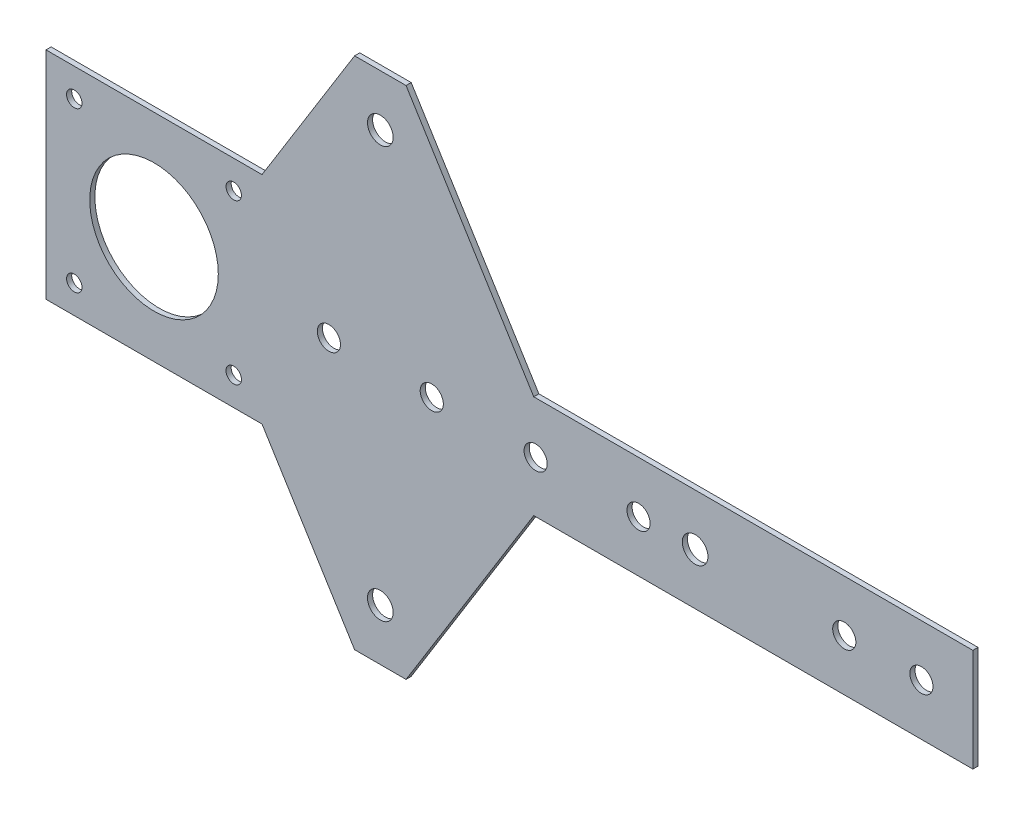
ISO-10303-21;
HEADER;
FILE_DESCRIPTION(('STEP AP214'),'2;1');
FILE_NAME('part.step','',(''),(''),'','','');
FILE_SCHEMA(('AUTOMOTIVE_DESIGN { 1 0 10303 214 1 1 1 1 }'));
ENDSEC;
DATA;
#1=APPLICATION_CONTEXT('core data for automotive mechanical design processes');
#2=APPLICATION_PROTOCOL_DEFINITION('international standard','automotive_design',2000,#1);
#3=PRODUCT_CONTEXT('',#1,'mechanical');
#4=PRODUCT('Part','Part','',(#3));
#5=PRODUCT_RELATED_PRODUCT_CATEGORY('part','',(#4));
#6=PRODUCT_DEFINITION_FORMATION('','',#4);
#7=PRODUCT_DEFINITION_CONTEXT('part definition',#1,'design');
#8=PRODUCT_DEFINITION('design','',#6,#7);
#9=PRODUCT_DEFINITION_SHAPE('','',#8);
#10=(LENGTH_UNIT() NAMED_UNIT(*) SI_UNIT(.MILLI.,.METRE.));
#11=(NAMED_UNIT(*) PLANE_ANGLE_UNIT() SI_UNIT($,.RADIAN.));
#12=(NAMED_UNIT(*) SI_UNIT($,.STERADIAN.) SOLID_ANGLE_UNIT());
#13=UNCERTAINTY_MEASURE_WITH_UNIT(LENGTH_MEASURE(1.E-05),#10,'distance_accuracy_value','');
#14=(GEOMETRIC_REPRESENTATION_CONTEXT(3) GLOBAL_UNCERTAINTY_ASSIGNED_CONTEXT((#13)) GLOBAL_UNIT_ASSIGNED_CONTEXT((#10,
#11,#12)) REPRESENTATION_CONTEXT('',''));
#15=CARTESIAN_POINT('',(0.,0.,0.));
#16=DIRECTION('',(0.,0.,1.));
#17=DIRECTION('',(1.,0.,0.));
#18=AXIS2_PLACEMENT_3D('',#15,#16,#17);
#19=CARTESIAN_POINT('',(-90.1,-21.,-1.));
#20=DIRECTION('',(-1.,0.,0.));
#21=DIRECTION('',(0.,0.,1.));
#22=AXIS2_PLACEMENT_3D('',#19,#20,#21);
#23=PLANE('',#22);
#24=DIRECTION('',(0.,-1.,0.));
#25=VECTOR('',#24,1.);
#26=CARTESIAN_POINT('',(-90.1,-21.,0.));
#27=LINE('',#26,#25);
#28=CARTESIAN_POINT('',(-90.1,21.,0.));
#29=VERTEX_POINT('',#28);
#30=CARTESIAN_POINT('',(-90.1,-21.,0.));
#31=VERTEX_POINT('',#30);
#32=EDGE_CURVE('E160',#29,#31,#27,.T.);
#33=ORIENTED_EDGE('',*,*,#32,.F.);
#34=DIRECTION('',(0.,0.,1.));
#35=VECTOR('',#34,1.);
#36=CARTESIAN_POINT('',(-90.1,21.,-1.));
#37=LINE('',#36,#35);
#38=CARTESIAN_POINT('',(-90.1,21.,-1.));
#39=VERTEX_POINT('',#38);
#40=EDGE_CURVE('E11',#39,#29,#37,.T.);
#41=ORIENTED_EDGE('',*,*,#40,.F.);
#42=DIRECTION('',(0.,-1.,0.));
#43=VECTOR('',#42,1.);
#44=CARTESIAN_POINT('',(-90.1,-21.,-1.));
#45=LINE('',#44,#43);
#46=CARTESIAN_POINT('',(-90.1,-21.,-1.));
#47=VERTEX_POINT('',#46);
#48=EDGE_CURVE('E193',#39,#47,#45,.T.);
#49=ORIENTED_EDGE('',*,*,#48,.T.);
#50=DIRECTION('',(0.,0.,1.));
#51=VECTOR('',#50,1.);
#52=CARTESIAN_POINT('',(-90.1,-21.,-1.));
#53=LINE('',#52,#51);
#54=EDGE_CURVE('E42',#47,#31,#53,.T.);
#55=ORIENTED_EDGE('',*,*,#54,.T.);
#56=EDGE_LOOP('',(#33,#41,#49,#55));
#57=FACE_BOUND('',#56,.T.);
#58=ADVANCED_FACE('F39',(#57),#23,.T.);
#59=CARTESIAN_POINT('',(-90.1,21.,-1.));
#60=DIRECTION('',(0.,1.,0.));
#61=DIRECTION('',(-1.,0.,0.));
#62=AXIS2_PLACEMENT_3D('',#59,#60,#61);
#63=PLANE('',#62);
#64=DIRECTION('',(-1.,0.,0.));
#65=VECTOR('',#64,1.);
#66=CARTESIAN_POINT('',(-90.1,21.,0.));
#67=LINE('',#66,#65);
#68=CARTESIAN_POINT('',(-48.1,21.,0.));
#69=VERTEX_POINT('',#68);
#70=EDGE_CURVE('E191',#69,#29,#67,.T.);
#71=ORIENTED_EDGE('',*,*,#70,.F.);
#72=DIRECTION('',(0.,0.,1.));
#73=VECTOR('',#72,1.);
#74=CARTESIAN_POINT('',(-48.1,21.,-1.));
#75=LINE('',#74,#73);
#76=CARTESIAN_POINT('',(-48.1,21.,-1.));
#77=VERTEX_POINT('',#76);
#78=EDGE_CURVE('E48',#77,#69,#75,.T.);
#79=ORIENTED_EDGE('',*,*,#78,.F.);
#80=DIRECTION('',(-1.,0.,0.));
#81=VECTOR('',#80,1.);
#82=CARTESIAN_POINT('',(-90.1,21.,-1.));
#83=LINE('',#82,#81);
#84=EDGE_CURVE('E150',#77,#39,#83,.T.);
#85=ORIENTED_EDGE('',*,*,#84,.T.);
#86=ORIENTED_EDGE('',*,*,#40,.T.);
#87=EDGE_LOOP('',(#71,#79,#85,#86));
#88=FACE_BOUND('',#87,.T.);
#89=ADVANCED_FACE('F213',(#88),#63,.T.);
#90=CARTESIAN_POINT('',(-48.1,21.,-1.));
#91=DIRECTION('',(-0.849640166198119,0.527362861778144,0.));
#92=DIRECTION('',(-0.527362861778144,-0.849640166198119,0.));
#93=AXIS2_PLACEMENT_3D('',#90,#91,#92);
#94=PLANE('',#93);
#95=DIRECTION('',(-0.527362861778144,-0.849640166198119,0.));
#96=VECTOR('',#95,1.);
#97=CARTESIAN_POINT('',(-48.1,21.,0.));
#98=LINE('',#97,#96);
#99=CARTESIAN_POINT('',(-30.1,50.,0.));
#100=VERTEX_POINT('',#99);
#101=EDGE_CURVE('E137',#100,#69,#98,.T.);
#102=ORIENTED_EDGE('',*,*,#101,.F.);
#103=DIRECTION('',(0.,0.,1.));
#104=VECTOR('',#103,1.);
#105=CARTESIAN_POINT('',(-30.1,50.,-1.));
#106=LINE('',#105,#104);
#107=CARTESIAN_POINT('',(-30.1,50.,-1.));
#108=VERTEX_POINT('',#107);
#109=EDGE_CURVE('E132',#108,#100,#106,.T.);
#110=ORIENTED_EDGE('',*,*,#109,.F.);
#111=DIRECTION('',(-0.527362861778144,-0.849640166198119,0.));
#112=VECTOR('',#111,1.);
#113=CARTESIAN_POINT('',(-48.1,21.,-1.));
#114=LINE('',#113,#112);
#115=EDGE_CURVE('E135',#108,#77,#114,.T.);
#116=ORIENTED_EDGE('',*,*,#115,.T.);
#117=ORIENTED_EDGE('',*,*,#78,.T.);
#118=EDGE_LOOP('',(#102,#110,#116,#117));
#119=FACE_BOUND('',#118,.T.);
#120=ADVANCED_FACE('F134',(#119),#94,.T.);
#121=CARTESIAN_POINT('',(-30.1,50.,-1.));
#122=DIRECTION('',(0.,1.,0.));
#123=DIRECTION('',(0.,0.,1.));
#124=AXIS2_PLACEMENT_3D('',#121,#122,#123);
#125=PLANE('',#124);
#126=DIRECTION('',(-1.,0.,0.));
#127=VECTOR('',#126,1.);
#128=CARTESIAN_POINT('',(-30.1,50.,0.));
#129=LINE('',#128,#127);
#130=CARTESIAN_POINT('',(-20.1,50.,0.));
#131=VERTEX_POINT('',#130);
#132=EDGE_CURVE('E188',#131,#100,#129,.T.);
#133=ORIENTED_EDGE('',*,*,#132,.F.);
#134=DIRECTION('',(0.,0.,1.));
#135=VECTOR('',#134,1.);
#136=CARTESIAN_POINT('',(-20.1,50.,-1.));
#137=LINE('',#136,#135);
#138=CARTESIAN_POINT('',(-20.1,50.,-1.));
#139=VERTEX_POINT('',#138);
#140=EDGE_CURVE('E142',#139,#131,#137,.T.);
#141=ORIENTED_EDGE('',*,*,#140,.F.);
#142=DIRECTION('',(-1.,0.,0.));
#143=VECTOR('',#142,1.);
#144=CARTESIAN_POINT('',(-30.1,50.,-1.));
#145=LINE('',#144,#143);
#146=EDGE_CURVE('E148',#139,#108,#145,.T.);
#147=ORIENTED_EDGE('',*,*,#146,.T.);
#148=ORIENTED_EDGE('',*,*,#109,.T.);
#149=EDGE_LOOP('',(#133,#141,#147,#148));
#150=FACE_BOUND('',#149,.T.);
#151=ADVANCED_FACE('F152',(#150),#125,.T.);
#152=CARTESIAN_POINT('',(-20.1,50.,-1.));
#153=DIRECTION('',(0.849640166198119,0.527362861778144,0.));
#154=DIRECTION('',(-0.527362861778144,0.849640166198118,0.));
#155=AXIS2_PLACEMENT_3D('',#152,#153,#154);
#156=PLANE('',#155);
#157=DIRECTION('',(-0.527362861778144,0.849640166198118,0.));
#158=VECTOR('',#157,1.);
#159=CARTESIAN_POINT('',(-20.1,50.,0.));
#160=LINE('',#159,#158);
#161=CARTESIAN_POINT('',(4.72758620689661,10.,0.));
#162=VERTEX_POINT('',#161);
#163=EDGE_CURVE('E185',#162,#131,#160,.T.);
#164=ORIENTED_EDGE('',*,*,#163,.F.);
#165=DIRECTION('',(0.,0.,1.));
#166=VECTOR('',#165,1.);
#167=CARTESIAN_POINT('',(4.72758620689661,10.,-1.));
#168=LINE('',#167,#166);
#169=CARTESIAN_POINT('',(4.72758620689661,10.,-1.));
#170=VERTEX_POINT('',#169);
#171=EDGE_CURVE('E197',#170,#162,#168,.T.);
#172=ORIENTED_EDGE('',*,*,#171,.F.);
#173=DIRECTION('',(-0.527362861778144,0.849640166198118,0.));
#174=VECTOR('',#173,1.);
#175=CARTESIAN_POINT('',(-20.1,50.,-1.));
#176=LINE('',#175,#174);
#177=EDGE_CURVE('E153',#170,#139,#176,.T.);
#178=ORIENTED_EDGE('',*,*,#177,.T.);
#179=ORIENTED_EDGE('',*,*,#140,.T.);
#180=EDGE_LOOP('',(#164,#172,#178,#179));
#181=FACE_BOUND('',#180,.T.);
#182=ADVANCED_FACE('F226',(#181),#156,.T.);
#183=CARTESIAN_POINT('',(4.72758620689661,10.,-1.));
#184=DIRECTION('',(0.,1.,0.));
#185=DIRECTION('',(0.,0.,1.));
#186=AXIS2_PLACEMENT_3D('',#183,#184,#185);
#187=PLANE('',#186);
#188=DIRECTION('',(-1.,0.,0.));
#189=VECTOR('',#188,1.);
#190=CARTESIAN_POINT('',(4.72758620689661,10.,0.));
#191=LINE('',#190,#189);
#192=CARTESIAN_POINT('',(90.1,10.,0.));
#193=VERTEX_POINT('',#192);
#194=EDGE_CURVE('E182',#193,#162,#191,.T.);
#195=ORIENTED_EDGE('',*,*,#194,.F.);
#196=DIRECTION('',(0.,0.,1.));
#197=VECTOR('',#196,1.);
#198=CARTESIAN_POINT('',(90.1,10.,-1.));
#199=LINE('',#198,#197);
#200=CARTESIAN_POINT('',(90.1,10.,-1.));
#201=VERTEX_POINT('',#200);
#202=EDGE_CURVE('E199',#201,#193,#199,.T.);
#203=ORIENTED_EDGE('',*,*,#202,.F.);
#204=DIRECTION('',(-1.,0.,0.));
#205=VECTOR('',#204,1.);
#206=CARTESIAN_POINT('',(4.72758620689661,10.,-1.));
#207=LINE('',#206,#205);
#208=EDGE_CURVE('E155',#201,#170,#207,.T.);
#209=ORIENTED_EDGE('',*,*,#208,.T.);
#210=ORIENTED_EDGE('',*,*,#171,.T.);
#211=EDGE_LOOP('',(#195,#203,#209,#210));
#212=FACE_BOUND('',#211,.T.);
#213=ADVANCED_FACE('F229',(#212),#187,.T.);
#214=CARTESIAN_POINT('',(90.1,-10.,-1.));
#215=DIRECTION('',(1.,0.,0.));
#216=DIRECTION('',(0.,0.,-1.));
#217=AXIS2_PLACEMENT_3D('',#214,#215,#216);
#218=PLANE('',#217);
#219=DIRECTION('',(0.,1.,0.));
#220=VECTOR('',#219,1.);
#221=CARTESIAN_POINT('',(90.1,-10.,0.));
#222=LINE('',#221,#220);
#223=CARTESIAN_POINT('',(90.1,-10.,0.));
#224=VERTEX_POINT('',#223);
#225=EDGE_CURVE('E179',#224,#193,#222,.T.);
#226=ORIENTED_EDGE('',*,*,#225,.F.);
#227=DIRECTION('',(0.,0.,1.));
#228=VECTOR('',#227,1.);
#229=CARTESIAN_POINT('',(90.1,-10.,-1.));
#230=LINE('',#229,#228);
#231=CARTESIAN_POINT('',(90.1,-10.,-1.));
#232=VERTEX_POINT('',#231);
#233=EDGE_CURVE('E201',#232,#224,#230,.T.);
#234=ORIENTED_EDGE('',*,*,#233,.F.);
#235=DIRECTION('',(0.,1.,0.));
#236=VECTOR('',#235,1.);
#237=CARTESIAN_POINT('',(90.1,-10.,-1.));
#238=LINE('',#237,#236);
#239=EDGE_CURVE('E423',#232,#201,#238,.T.);
#240=ORIENTED_EDGE('',*,*,#239,.T.);
#241=ORIENTED_EDGE('',*,*,#202,.T.);
#242=EDGE_LOOP('',(#226,#234,#240,#241));
#243=FACE_BOUND('',#242,.T.);
#244=ADVANCED_FACE('F233',(#243),#218,.T.);
#245=CARTESIAN_POINT('',(4.72758620689661,-10.,-1.));
#246=DIRECTION('',(0.,-1.,0.));
#247=DIRECTION('',(0.,0.,-1.));
#248=AXIS2_PLACEMENT_3D('',#245,#246,#247);
#249=PLANE('',#248);
#250=DIRECTION('',(1.,0.,0.));
#251=VECTOR('',#250,1.);
#252=CARTESIAN_POINT('',(4.72758620689661,-10.,0.));
#253=LINE('',#252,#251);
#254=CARTESIAN_POINT('',(4.72758620689661,-10.,0.));
#255=VERTEX_POINT('',#254);
#256=EDGE_CURVE('E176',#255,#224,#253,.T.);
#257=ORIENTED_EDGE('',*,*,#256,.F.);
#258=DIRECTION('',(0.,0.,1.));
#259=VECTOR('',#258,1.);
#260=CARTESIAN_POINT('',(4.72758620689661,-10.,-1.));
#261=LINE('',#260,#259);
#262=CARTESIAN_POINT('',(4.72758620689661,-10.,-1.));
#263=VERTEX_POINT('',#262);
#264=EDGE_CURVE('E203',#263,#255,#261,.T.);
#265=ORIENTED_EDGE('',*,*,#264,.F.);
#266=DIRECTION('',(1.,0.,0.));
#267=VECTOR('',#266,1.);
#268=CARTESIAN_POINT('',(4.72758620689661,-10.,-1.));
#269=LINE('',#268,#267);
#270=EDGE_CURVE('E420',#263,#232,#269,.T.);
#271=ORIENTED_EDGE('',*,*,#270,.T.);
#272=ORIENTED_EDGE('',*,*,#233,.T.);
#273=EDGE_LOOP('',(#257,#265,#271,#272));
#274=FACE_BOUND('',#273,.T.);
#275=ADVANCED_FACE('F237',(#274),#249,.T.);
#276=CARTESIAN_POINT('',(-20.1,-50.,-1.));
#277=DIRECTION('',(0.849640166198119,-0.527362861778144,0.));
#278=DIRECTION('',(0.527362861778144,0.849640166198118,0.));
#279=AXIS2_PLACEMENT_3D('',#276,#277,#278);
#280=PLANE('',#279);
#281=DIRECTION('',(0.527362861778144,0.849640166198118,0.));
#282=VECTOR('',#281,1.);
#283=CARTESIAN_POINT('',(-20.1,-50.,0.));
#284=LINE('',#283,#282);
#285=CARTESIAN_POINT('',(-20.1,-50.,0.));
#286=VERTEX_POINT('',#285);
#287=EDGE_CURVE('E173',#286,#255,#284,.T.);
#288=ORIENTED_EDGE('',*,*,#287,.F.);
#289=DIRECTION('',(0.,0.,1.));
#290=VECTOR('',#289,1.);
#291=CARTESIAN_POINT('',(-20.1,-50.,-1.));
#292=LINE('',#291,#290);
#293=CARTESIAN_POINT('',(-20.1,-50.,-1.));
#294=VERTEX_POINT('',#293);
#295=EDGE_CURVE('E205',#294,#286,#292,.T.);
#296=ORIENTED_EDGE('',*,*,#295,.F.);
#297=DIRECTION('',(0.527362861778144,0.849640166198118,0.));
#298=VECTOR('',#297,1.);
#299=CARTESIAN_POINT('',(-20.1,-50.,-1.));
#300=LINE('',#299,#298);
#301=EDGE_CURVE('E417',#294,#263,#300,.T.);
#302=ORIENTED_EDGE('',*,*,#301,.T.);
#303=ORIENTED_EDGE('',*,*,#264,.T.);
#304=EDGE_LOOP('',(#288,#296,#302,#303));
#305=FACE_BOUND('',#304,.T.);
#306=ADVANCED_FACE('F241',(#305),#280,.T.);
#307=CARTESIAN_POINT('',(-30.1,-50.,-1.));
#308=DIRECTION('',(0.,-1.,0.));
#309=DIRECTION('',(0.,0.,-1.));
#310=AXIS2_PLACEMENT_3D('',#307,#308,#309);
#311=PLANE('',#310);
#312=DIRECTION('',(1.,0.,0.));
#313=VECTOR('',#312,1.);
#314=CARTESIAN_POINT('',(-30.1,-50.,0.));
#315=LINE('',#314,#313);
#316=CARTESIAN_POINT('',(-30.1,-50.,0.));
#317=VERTEX_POINT('',#316);
#318=EDGE_CURVE('E170',#317,#286,#315,.T.);
#319=ORIENTED_EDGE('',*,*,#318,.F.);
#320=DIRECTION('',(0.,0.,1.));
#321=VECTOR('',#320,1.);
#322=CARTESIAN_POINT('',(-30.1,-50.,-1.));
#323=LINE('',#322,#321);
#324=CARTESIAN_POINT('',(-30.1,-50.,-1.));
#325=VERTEX_POINT('',#324);
#326=EDGE_CURVE('E207',#325,#317,#323,.T.);
#327=ORIENTED_EDGE('',*,*,#326,.F.);
#328=DIRECTION('',(1.,0.,0.));
#329=VECTOR('',#328,1.);
#330=CARTESIAN_POINT('',(-30.1,-50.,-1.));
#331=LINE('',#330,#329);
#332=EDGE_CURVE('E414',#325,#294,#331,.T.);
#333=ORIENTED_EDGE('',*,*,#332,.T.);
#334=ORIENTED_EDGE('',*,*,#295,.T.);
#335=EDGE_LOOP('',(#319,#327,#333,#334));
#336=FACE_BOUND('',#335,.T.);
#337=ADVANCED_FACE('F245',(#336),#311,.T.);
#338=CARTESIAN_POINT('',(-48.1,-21.,-1.));
#339=DIRECTION('',(-0.849640166198119,-0.527362861778144,0.));
#340=DIRECTION('',(0.527362861778144,-0.849640166198119,0.));
#341=AXIS2_PLACEMENT_3D('',#338,#339,#340);
#342=PLANE('',#341);
#343=DIRECTION('',(0.527362861778144,-0.849640166198119,0.));
#344=VECTOR('',#343,1.);
#345=CARTESIAN_POINT('',(-48.1,-21.,0.));
#346=LINE('',#345,#344);
#347=CARTESIAN_POINT('',(-48.1,-21.,0.));
#348=VERTEX_POINT('',#347);
#349=EDGE_CURVE('E167',#348,#317,#346,.T.);
#350=ORIENTED_EDGE('',*,*,#349,.F.);
#351=DIRECTION('',(0.,0.,1.));
#352=VECTOR('',#351,1.);
#353=CARTESIAN_POINT('',(-48.1,-21.,-1.));
#354=LINE('',#353,#352);
#355=CARTESIAN_POINT('',(-48.1,-21.,-1.));
#356=VERTEX_POINT('',#355);
#357=EDGE_CURVE('E208',#356,#348,#354,.T.);
#358=ORIENTED_EDGE('',*,*,#357,.F.);
#359=DIRECTION('',(0.527362861778144,-0.849640166198119,0.));
#360=VECTOR('',#359,1.);
#361=CARTESIAN_POINT('',(-48.1,-21.,-1.));
#362=LINE('',#361,#360);
#363=EDGE_CURVE('E411',#356,#325,#362,.T.);
#364=ORIENTED_EDGE('',*,*,#363,.T.);
#365=ORIENTED_EDGE('',*,*,#326,.T.);
#366=EDGE_LOOP('',(#350,#358,#364,#365));
#367=FACE_BOUND('',#366,.T.);
#368=ADVANCED_FACE('F249',(#367),#342,.T.);
#369=CARTESIAN_POINT('',(-90.1,-21.,-1.));
#370=DIRECTION('',(0.,-1.,0.));
#371=DIRECTION('',(1.,0.,0.));
#372=AXIS2_PLACEMENT_3D('',#369,#370,#371);
#373=PLANE('',#372);
#374=DIRECTION('',(1.,0.,0.));
#375=VECTOR('',#374,1.);
#376=CARTESIAN_POINT('',(-90.1,-21.,0.));
#377=LINE('',#376,#375);
#378=EDGE_CURVE('E163',#31,#348,#377,.T.);
#379=ORIENTED_EDGE('',*,*,#378,.F.);
#380=ORIENTED_EDGE('',*,*,#54,.F.);
#381=DIRECTION('',(1.,0.,0.));
#382=VECTOR('',#381,1.);
#383=CARTESIAN_POINT('',(-90.1,-21.,-1.));
#384=LINE('',#383,#382);
#385=EDGE_CURVE('E409',#47,#356,#384,.T.);
#386=ORIENTED_EDGE('',*,*,#385,.T.);
#387=ORIENTED_EDGE('',*,*,#357,.T.);
#388=EDGE_LOOP('',(#379,#380,#386,#387));
#389=FACE_BOUND('',#388,.T.);
#390=ADVANCED_FACE('F210',(#389),#373,.T.);
#391=CARTESIAN_POINT('',(0.,0.,-1.));
#392=DIRECTION('',(0.,0.,-1.));
#393=DIRECTION('',(-1.,0.,0.));
#394=AXIS2_PLACEMENT_3D('',#391,#392,#393);
#395=PLANE('',#394);
#396=CARTESIAN_POINT('',(-84.6,-15.5,-1.));
#397=DIRECTION('',(0.,0.,1.));
#398=DIRECTION('',(1.,0.,0.));
#399=AXIS2_PLACEMENT_3D('',#396,#397,#398);
#400=CIRCLE('',#399,1.5);
#401=CARTESIAN_POINT('',(-83.1,-15.5,-1.));
#402=VERTEX_POINT('',#401);
#403=EDGE_CURVE('E324',#402,#402,#400,.T.);
#404=ORIENTED_EDGE('',*,*,#403,.T.);
#405=EDGE_LOOP('',(#404));
#406=FACE_BOUND('',#405,.T.);
#407=CARTESIAN_POINT('',(-53.6,-15.5,-1.));
#408=DIRECTION('',(0.,0.,1.));
#409=DIRECTION('',(1.,0.,0.));
#410=AXIS2_PLACEMENT_3D('',#407,#408,#409);
#411=CIRCLE('',#410,1.5);
#412=CARTESIAN_POINT('',(-52.1,-15.5,-1.));
#413=VERTEX_POINT('',#412);
#414=EDGE_CURVE('E332',#413,#413,#411,.T.);
#415=ORIENTED_EDGE('',*,*,#414,.T.);
#416=EDGE_LOOP('',(#415));
#417=FACE_BOUND('',#416,.T.);
#418=CARTESIAN_POINT('',(-35.1,0.,-1.));
#419=DIRECTION('',(0.,0.,1.));
#420=DIRECTION('',(1.,0.,0.));
#421=AXIS2_PLACEMENT_3D('',#418,#419,#420);
#422=CIRCLE('',#421,2.25);
#423=CARTESIAN_POINT('',(-32.85,0.,-1.));
#424=VERTEX_POINT('',#423);
#425=EDGE_CURVE('E338',#424,#424,#422,.T.);
#426=ORIENTED_EDGE('',*,*,#425,.T.);
#427=EDGE_LOOP('',(#426));
#428=FACE_BOUND('',#427,.T.);
#429=CARTESIAN_POINT('',(-15.1,0.,-1.));
#430=DIRECTION('',(0.,0.,1.));
#431=DIRECTION('',(1.,0.,0.));
#432=AXIS2_PLACEMENT_3D('',#429,#430,#431);
#433=CIRCLE('',#432,2.25);
#434=CARTESIAN_POINT('',(-12.85,0.,-1.));
#435=VERTEX_POINT('',#434);
#436=EDGE_CURVE('E344',#435,#435,#433,.T.);
#437=ORIENTED_EDGE('',*,*,#436,.T.);
#438=EDGE_LOOP('',(#437));
#439=FACE_BOUND('',#438,.T.);
#440=CARTESIAN_POINT('',(-25.1,40.,-1.));
#441=DIRECTION('',(0.,0.,1.));
#442=DIRECTION('',(-1.,0.,0.));
#443=AXIS2_PLACEMENT_3D('',#440,#441,#442);
#444=CIRCLE('',#443,2.5);
#445=CARTESIAN_POINT('',(-27.6,40.,-1.));
#446=VERTEX_POINT('',#445);
#447=EDGE_CURVE('E350',#446,#446,#444,.T.);
#448=ORIENTED_EDGE('',*,*,#447,.T.);
#449=EDGE_LOOP('',(#448));
#450=FACE_BOUND('',#449,.T.);
#451=CARTESIAN_POINT('',(36.1,0.,-1.));
#452=DIRECTION('',(0.,0.,1.));
#453=DIRECTION('',(1.,0.,0.));
#454=AXIS2_PLACEMENT_3D('',#451,#452,#453);
#455=CIRCLE('',#454,2.49999999999999);
#456=CARTESIAN_POINT('',(38.6,0.,-1.));
#457=VERTEX_POINT('',#456);
#458=EDGE_CURVE('E356',#457,#457,#455,.T.);
#459=ORIENTED_EDGE('',*,*,#458,.T.);
#460=EDGE_LOOP('',(#459));
#461=FACE_BOUND('',#460,.T.);
#462=CARTESIAN_POINT('',(5.1,0.,-1.));
#463=DIRECTION('',(0.,0.,1.));
#464=DIRECTION('',(1.,0.,0.));
#465=AXIS2_PLACEMENT_3D('',#462,#463,#464);
#466=CIRCLE('',#465,2.25);
#467=CARTESIAN_POINT('',(7.35000000000001,0.,-1.));
#468=VERTEX_POINT('',#467);
#469=EDGE_CURVE('E362',#468,#468,#466,.T.);
#470=ORIENTED_EDGE('',*,*,#469,.T.);
#471=EDGE_LOOP('',(#470));
#472=FACE_BOUND('',#471,.T.);
#473=CARTESIAN_POINT('',(25.1,0.,-1.));
#474=DIRECTION('',(0.,0.,1.));
#475=DIRECTION('',(1.,0.,0.));
#476=AXIS2_PLACEMENT_3D('',#473,#474,#475);
#477=CIRCLE('',#476,2.25);
#478=CARTESIAN_POINT('',(27.35,0.,-1.));
#479=VERTEX_POINT('',#478);
#480=EDGE_CURVE('E368',#479,#479,#477,.T.);
#481=ORIENTED_EDGE('',*,*,#480,.T.);
#482=EDGE_LOOP('',(#481));
#483=FACE_BOUND('',#482,.T.);
#484=CARTESIAN_POINT('',(65.1,0.,-1.));
#485=DIRECTION('',(0.,0.,1.));
#486=DIRECTION('',(1.,0.,0.));
#487=AXIS2_PLACEMENT_3D('',#484,#485,#486);
#488=CIRCLE('',#487,2.24999999999999);
#489=CARTESIAN_POINT('',(67.35,0.,-1.));
#490=VERTEX_POINT('',#489);
#491=EDGE_CURVE('E374',#490,#490,#488,.T.);
#492=ORIENTED_EDGE('',*,*,#491,.T.);
#493=EDGE_LOOP('',(#492));
#494=FACE_BOUND('',#493,.T.);
#495=CARTESIAN_POINT('',(-25.1,-40.,-1.));
#496=DIRECTION('',(0.,0.,1.));
#497=DIRECTION('',(1.,0.,0.));
#498=AXIS2_PLACEMENT_3D('',#495,#496,#497);
#499=CIRCLE('',#498,2.5);
#500=CARTESIAN_POINT('',(-22.6,-40.,-1.));
#501=VERTEX_POINT('',#500);
#502=EDGE_CURVE('E380',#501,#501,#499,.T.);
#503=ORIENTED_EDGE('',*,*,#502,.T.);
#504=EDGE_LOOP('',(#503));
#505=FACE_BOUND('',#504,.T.);
#506=CARTESIAN_POINT('',(-53.6,15.5,-1.));
#507=DIRECTION('',(0.,0.,1.));
#508=DIRECTION('',(1.,0.,0.));
#509=AXIS2_PLACEMENT_3D('',#506,#507,#508);
#510=CIRCLE('',#509,1.5);
#511=CARTESIAN_POINT('',(-52.1,15.5,-1.));
#512=VERTEX_POINT('',#511);
#513=EDGE_CURVE('E386',#512,#512,#510,.T.);
#514=ORIENTED_EDGE('',*,*,#513,.T.);
#515=EDGE_LOOP('',(#514));
#516=FACE_BOUND('',#515,.T.);
#517=CARTESIAN_POINT('',(80.1,0.,-1.));
#518=DIRECTION('',(0.,0.,1.));
#519=DIRECTION('',(1.,0.,0.));
#520=AXIS2_PLACEMENT_3D('',#517,#518,#519);
#521=CIRCLE('',#520,2.25000000000001);
#522=CARTESIAN_POINT('',(82.35,0.,-1.));
#523=VERTEX_POINT('',#522);
#524=EDGE_CURVE('E392',#523,#523,#521,.T.);
#525=ORIENTED_EDGE('',*,*,#524,.T.);
#526=EDGE_LOOP('',(#525));
#527=FACE_BOUND('',#526,.T.);
#528=CARTESIAN_POINT('',(-84.6,15.5,-1.));
#529=DIRECTION('',(0.,0.,1.));
#530=DIRECTION('',(1.,0.,0.));
#531=AXIS2_PLACEMENT_3D('',#528,#529,#530);
#532=CIRCLE('',#531,1.5);
#533=CARTESIAN_POINT('',(-83.1,15.5,-1.));
#534=VERTEX_POINT('',#533);
#535=EDGE_CURVE('E398',#534,#534,#532,.T.);
#536=ORIENTED_EDGE('',*,*,#535,.T.);
#537=EDGE_LOOP('',(#536));
#538=FACE_BOUND('',#537,.T.);
#539=CARTESIAN_POINT('',(-69.1,0.,-1.));
#540=DIRECTION('',(0.,0.,1.));
#541=DIRECTION('',(1.,0.,0.));
#542=AXIS2_PLACEMENT_3D('',#539,#540,#541);
#543=CIRCLE('',#542,12.5);
#544=CARTESIAN_POINT('',(-56.6,0.,-1.));
#545=VERTEX_POINT('',#544);
#546=EDGE_CURVE('E164',#545,#545,#543,.T.);
#547=ORIENTED_EDGE('',*,*,#546,.T.);
#548=EDGE_LOOP('',(#547));
#549=FACE_BOUND('',#548,.T.);
#550=ORIENTED_EDGE('',*,*,#48,.F.);
#551=ORIENTED_EDGE('',*,*,#84,.F.);
#552=ORIENTED_EDGE('',*,*,#115,.F.);
#553=ORIENTED_EDGE('',*,*,#146,.F.);
#554=ORIENTED_EDGE('',*,*,#177,.F.);
#555=ORIENTED_EDGE('',*,*,#208,.F.);
#556=ORIENTED_EDGE('',*,*,#239,.F.);
#557=ORIENTED_EDGE('',*,*,#270,.F.);
#558=ORIENTED_EDGE('',*,*,#301,.F.);
#559=ORIENTED_EDGE('',*,*,#332,.F.);
#560=ORIENTED_EDGE('',*,*,#363,.F.);
#561=ORIENTED_EDGE('',*,*,#385,.F.);
#562=EDGE_LOOP('',(#550,#551,#552,#553,#554,#555,#556,#557,#558,#559,#560,#561));
#563=FACE_BOUND('',#562,.T.);
#564=ADVANCED_FACE('F146',(#406,#417,#428,#439,#450,#461,#472,#483,#494,#505,#516,#527,#538,
#549,#563),#395,.T.);
#565=CARTESIAN_POINT('',(0.,0.,0.));
#566=DIRECTION('',(0.,0.,-1.));
#567=DIRECTION('',(-1.,0.,0.));
#568=AXIS2_PLACEMENT_3D('',#565,#566,#567);
#569=PLANE('',#568);
#570=CARTESIAN_POINT('',(-84.6,-15.5,0.));
#571=DIRECTION('',(0.,0.,1.));
#572=DIRECTION('',(1.,0.,0.));
#573=AXIS2_PLACEMENT_3D('',#570,#571,#572);
#574=CIRCLE('',#573,1.5);
#575=CARTESIAN_POINT('',(-83.1,-15.5,0.));
#576=VERTEX_POINT('',#575);
#577=EDGE_CURVE('E327',#576,#576,#574,.T.);
#578=ORIENTED_EDGE('',*,*,#577,.F.);
#579=EDGE_LOOP('',(#578));
#580=FACE_BOUND('',#579,.T.);
#581=CARTESIAN_POINT('',(-53.6,-15.5,0.));
#582=DIRECTION('',(0.,0.,1.));
#583=DIRECTION('',(1.,0.,0.));
#584=AXIS2_PLACEMENT_3D('',#581,#582,#583);
#585=CIRCLE('',#584,1.5);
#586=CARTESIAN_POINT('',(-52.1,-15.5,0.));
#587=VERTEX_POINT('',#586);
#588=EDGE_CURVE('E329',#587,#587,#585,.T.);
#589=ORIENTED_EDGE('',*,*,#588,.F.);
#590=EDGE_LOOP('',(#589));
#591=FACE_BOUND('',#590,.T.);
#592=CARTESIAN_POINT('',(-35.1,0.,0.));
#593=DIRECTION('',(0.,0.,1.));
#594=DIRECTION('',(1.,0.,0.));
#595=AXIS2_PLACEMENT_3D('',#592,#593,#594);
#596=CIRCLE('',#595,2.25);
#597=CARTESIAN_POINT('',(-32.85,0.,0.));
#598=VERTEX_POINT('',#597);
#599=EDGE_CURVE('E335',#598,#598,#596,.T.);
#600=ORIENTED_EDGE('',*,*,#599,.F.);
#601=EDGE_LOOP('',(#600));
#602=FACE_BOUND('',#601,.T.);
#603=CARTESIAN_POINT('',(-15.1,0.,0.));
#604=DIRECTION('',(0.,0.,1.));
#605=DIRECTION('',(1.,0.,0.));
#606=AXIS2_PLACEMENT_3D('',#603,#604,#605);
#607=CIRCLE('',#606,2.25);
#608=CARTESIAN_POINT('',(-12.85,0.,0.));
#609=VERTEX_POINT('',#608);
#610=EDGE_CURVE('E341',#609,#609,#607,.T.);
#611=ORIENTED_EDGE('',*,*,#610,.F.);
#612=EDGE_LOOP('',(#611));
#613=FACE_BOUND('',#612,.T.);
#614=CARTESIAN_POINT('',(-25.1,40.,0.));
#615=DIRECTION('',(0.,0.,1.));
#616=DIRECTION('',(-1.,0.,0.));
#617=AXIS2_PLACEMENT_3D('',#614,#615,#616);
#618=CIRCLE('',#617,2.5);
#619=CARTESIAN_POINT('',(-27.6,40.,0.));
#620=VERTEX_POINT('',#619);
#621=EDGE_CURVE('E347',#620,#620,#618,.T.);
#622=ORIENTED_EDGE('',*,*,#621,.F.);
#623=EDGE_LOOP('',(#622));
#624=FACE_BOUND('',#623,.T.);
#625=CARTESIAN_POINT('',(36.1,0.,0.));
#626=DIRECTION('',(0.,0.,1.));
#627=DIRECTION('',(1.,0.,0.));
#628=AXIS2_PLACEMENT_3D('',#625,#626,#627);
#629=CIRCLE('',#628,2.49999999999999);
#630=CARTESIAN_POINT('',(38.6,0.,0.));
#631=VERTEX_POINT('',#630);
#632=EDGE_CURVE('E353',#631,#631,#629,.T.);
#633=ORIENTED_EDGE('',*,*,#632,.F.);
#634=EDGE_LOOP('',(#633));
#635=FACE_BOUND('',#634,.T.);
#636=CARTESIAN_POINT('',(5.1,0.,0.));
#637=DIRECTION('',(0.,0.,1.));
#638=DIRECTION('',(1.,0.,0.));
#639=AXIS2_PLACEMENT_3D('',#636,#637,#638);
#640=CIRCLE('',#639,2.25);
#641=CARTESIAN_POINT('',(7.35000000000001,0.,0.));
#642=VERTEX_POINT('',#641);
#643=EDGE_CURVE('E359',#642,#642,#640,.T.);
#644=ORIENTED_EDGE('',*,*,#643,.F.);
#645=EDGE_LOOP('',(#644));
#646=FACE_BOUND('',#645,.T.);
#647=CARTESIAN_POINT('',(25.1,0.,0.));
#648=DIRECTION('',(0.,0.,1.));
#649=DIRECTION('',(1.,0.,0.));
#650=AXIS2_PLACEMENT_3D('',#647,#648,#649);
#651=CIRCLE('',#650,2.25);
#652=CARTESIAN_POINT('',(27.35,0.,0.));
#653=VERTEX_POINT('',#652);
#654=EDGE_CURVE('E365',#653,#653,#651,.T.);
#655=ORIENTED_EDGE('',*,*,#654,.F.);
#656=EDGE_LOOP('',(#655));
#657=FACE_BOUND('',#656,.T.);
#658=CARTESIAN_POINT('',(65.1,0.,0.));
#659=DIRECTION('',(0.,0.,1.));
#660=DIRECTION('',(1.,0.,0.));
#661=AXIS2_PLACEMENT_3D('',#658,#659,#660);
#662=CIRCLE('',#661,2.24999999999999);
#663=CARTESIAN_POINT('',(67.35,0.,0.));
#664=VERTEX_POINT('',#663);
#665=EDGE_CURVE('E371',#664,#664,#662,.T.);
#666=ORIENTED_EDGE('',*,*,#665,.F.);
#667=EDGE_LOOP('',(#666));
#668=FACE_BOUND('',#667,.T.);
#669=CARTESIAN_POINT('',(-25.1,-40.,0.));
#670=DIRECTION('',(0.,0.,1.));
#671=DIRECTION('',(1.,0.,0.));
#672=AXIS2_PLACEMENT_3D('',#669,#670,#671);
#673=CIRCLE('',#672,2.5);
#674=CARTESIAN_POINT('',(-22.6,-40.,0.));
#675=VERTEX_POINT('',#674);
#676=EDGE_CURVE('E377',#675,#675,#673,.T.);
#677=ORIENTED_EDGE('',*,*,#676,.F.);
#678=EDGE_LOOP('',(#677));
#679=FACE_BOUND('',#678,.T.);
#680=CARTESIAN_POINT('',(-53.6,15.5,0.));
#681=DIRECTION('',(0.,0.,1.));
#682=DIRECTION('',(1.,0.,0.));
#683=AXIS2_PLACEMENT_3D('',#680,#681,#682);
#684=CIRCLE('',#683,1.5);
#685=CARTESIAN_POINT('',(-52.1,15.5,0.));
#686=VERTEX_POINT('',#685);
#687=EDGE_CURVE('E383',#686,#686,#684,.T.);
#688=ORIENTED_EDGE('',*,*,#687,.F.);
#689=EDGE_LOOP('',(#688));
#690=FACE_BOUND('',#689,.T.);
#691=CARTESIAN_POINT('',(80.1,0.,0.));
#692=DIRECTION('',(0.,0.,1.));
#693=DIRECTION('',(1.,0.,0.));
#694=AXIS2_PLACEMENT_3D('',#691,#692,#693);
#695=CIRCLE('',#694,2.25000000000001);
#696=CARTESIAN_POINT('',(82.35,0.,0.));
#697=VERTEX_POINT('',#696);
#698=EDGE_CURVE('E389',#697,#697,#695,.T.);
#699=ORIENTED_EDGE('',*,*,#698,.F.);
#700=EDGE_LOOP('',(#699));
#701=FACE_BOUND('',#700,.T.);
#702=CARTESIAN_POINT('',(-84.6,15.5,0.));
#703=DIRECTION('',(0.,0.,1.));
#704=DIRECTION('',(1.,0.,0.));
#705=AXIS2_PLACEMENT_3D('',#702,#703,#704);
#706=CIRCLE('',#705,1.5);
#707=CARTESIAN_POINT('',(-83.1,15.5,0.));
#708=VERTEX_POINT('',#707);
#709=EDGE_CURVE('E395',#708,#708,#706,.T.);
#710=ORIENTED_EDGE('',*,*,#709,.F.);
#711=EDGE_LOOP('',(#710));
#712=FACE_BOUND('',#711,.T.);
#713=CARTESIAN_POINT('',(-69.1,0.,0.));
#714=DIRECTION('',(0.,0.,1.));
#715=DIRECTION('',(1.,0.,0.));
#716=AXIS2_PLACEMENT_3D('',#713,#714,#715);
#717=CIRCLE('',#716,12.5);
#718=CARTESIAN_POINT('',(-56.6,0.,0.));
#719=VERTEX_POINT('',#718);
#720=EDGE_CURVE('E401',#719,#719,#717,.T.);
#721=ORIENTED_EDGE('',*,*,#720,.F.);
#722=EDGE_LOOP('',(#721));
#723=FACE_BOUND('',#722,.T.);
#724=ORIENTED_EDGE('',*,*,#32,.T.);
#725=ORIENTED_EDGE('',*,*,#378,.T.);
#726=ORIENTED_EDGE('',*,*,#349,.T.);
#727=ORIENTED_EDGE('',*,*,#318,.T.);
#728=ORIENTED_EDGE('',*,*,#287,.T.);
#729=ORIENTED_EDGE('',*,*,#256,.T.);
#730=ORIENTED_EDGE('',*,*,#225,.T.);
#731=ORIENTED_EDGE('',*,*,#194,.T.);
#732=ORIENTED_EDGE('',*,*,#163,.T.);
#733=ORIENTED_EDGE('',*,*,#132,.T.);
#734=ORIENTED_EDGE('',*,*,#101,.T.);
#735=ORIENTED_EDGE('',*,*,#70,.T.);
#736=EDGE_LOOP('',(#724,#725,#726,#727,#728,#729,#730,#731,#732,#733,#734,#735));
#737=FACE_BOUND('',#736,.T.);
#738=ADVANCED_FACE('F212',(#580,#591,#602,#613,#624,#635,#646,#657,#668,#679,#690,#701,#712,
#723,#737),#569,.F.);
#739=CARTESIAN_POINT('',(-69.1,0.,-1.));
#740=DIRECTION('',(0.,0.,1.));
#741=DIRECTION('',(1.,0.,0.));
#742=AXIS2_PLACEMENT_3D('',#739,#740,#741);
#743=CYLINDRICAL_SURFACE('',#742,12.5);
#744=ORIENTED_EDGE('',*,*,#546,.F.);
#745=EDGE_LOOP('',(#744));
#746=FACE_BOUND('',#745,.T.);
#747=ORIENTED_EDGE('',*,*,#720,.T.);
#748=EDGE_LOOP('',(#747));
#749=FACE_BOUND('',#748,.T.);
#750=ADVANCED_FACE('F261',(#746,#749),#743,.F.);
#751=CARTESIAN_POINT('',(-84.6,15.5,-1.));
#752=DIRECTION('',(0.,0.,1.));
#753=DIRECTION('',(1.,0.,0.));
#754=AXIS2_PLACEMENT_3D('',#751,#752,#753);
#755=CYLINDRICAL_SURFACE('',#754,1.5);
#756=ORIENTED_EDGE('',*,*,#535,.F.);
#757=EDGE_LOOP('',(#756));
#758=FACE_BOUND('',#757,.T.);
#759=ORIENTED_EDGE('',*,*,#709,.T.);
#760=EDGE_LOOP('',(#759));
#761=FACE_BOUND('',#760,.T.);
#762=ADVANCED_FACE('F268',(#758,#761),#755,.F.);
#763=CARTESIAN_POINT('',(80.1,0.,-1.));
#764=DIRECTION('',(0.,0.,1.));
#765=DIRECTION('',(1.,0.,0.));
#766=AXIS2_PLACEMENT_3D('',#763,#764,#765);
#767=CYLINDRICAL_SURFACE('',#766,2.25000000000001);
#768=ORIENTED_EDGE('',*,*,#524,.F.);
#769=EDGE_LOOP('',(#768));
#770=FACE_BOUND('',#769,.T.);
#771=ORIENTED_EDGE('',*,*,#698,.T.);
#772=EDGE_LOOP('',(#771));
#773=FACE_BOUND('',#772,.T.);
#774=ADVANCED_FACE('F272',(#770,#773),#767,.F.);
#775=CARTESIAN_POINT('',(-53.6,15.5,-1.));
#776=DIRECTION('',(0.,0.,1.));
#777=DIRECTION('',(1.,0.,0.));
#778=AXIS2_PLACEMENT_3D('',#775,#776,#777);
#779=CYLINDRICAL_SURFACE('',#778,1.5);
#780=ORIENTED_EDGE('',*,*,#513,.F.);
#781=EDGE_LOOP('',(#780));
#782=FACE_BOUND('',#781,.T.);
#783=ORIENTED_EDGE('',*,*,#687,.T.);
#784=EDGE_LOOP('',(#783));
#785=FACE_BOUND('',#784,.T.);
#786=ADVANCED_FACE('F276',(#782,#785),#779,.F.);
#787=CARTESIAN_POINT('',(-25.1,-40.,-1.));
#788=DIRECTION('',(0.,0.,1.));
#789=DIRECTION('',(1.,0.,0.));
#790=AXIS2_PLACEMENT_3D('',#787,#788,#789);
#791=CYLINDRICAL_SURFACE('',#790,2.5);
#792=ORIENTED_EDGE('',*,*,#502,.F.);
#793=EDGE_LOOP('',(#792));
#794=FACE_BOUND('',#793,.T.);
#795=ORIENTED_EDGE('',*,*,#676,.T.);
#796=EDGE_LOOP('',(#795));
#797=FACE_BOUND('',#796,.T.);
#798=ADVANCED_FACE('F280',(#794,#797),#791,.F.);
#799=CARTESIAN_POINT('',(65.1,0.,-1.));
#800=DIRECTION('',(0.,0.,1.));
#801=DIRECTION('',(1.,0.,0.));
#802=AXIS2_PLACEMENT_3D('',#799,#800,#801);
#803=CYLINDRICAL_SURFACE('',#802,2.24999999999999);
#804=ORIENTED_EDGE('',*,*,#491,.F.);
#805=EDGE_LOOP('',(#804));
#806=FACE_BOUND('',#805,.T.);
#807=ORIENTED_EDGE('',*,*,#665,.T.);
#808=EDGE_LOOP('',(#807));
#809=FACE_BOUND('',#808,.T.);
#810=ADVANCED_FACE('F284',(#806,#809),#803,.F.);
#811=CARTESIAN_POINT('',(25.1,0.,-1.));
#812=DIRECTION('',(0.,0.,1.));
#813=DIRECTION('',(1.,0.,0.));
#814=AXIS2_PLACEMENT_3D('',#811,#812,#813);
#815=CYLINDRICAL_SURFACE('',#814,2.25);
#816=ORIENTED_EDGE('',*,*,#480,.F.);
#817=EDGE_LOOP('',(#816));
#818=FACE_BOUND('',#817,.T.);
#819=ORIENTED_EDGE('',*,*,#654,.T.);
#820=EDGE_LOOP('',(#819));
#821=FACE_BOUND('',#820,.T.);
#822=ADVANCED_FACE('F288',(#818,#821),#815,.F.);
#823=CARTESIAN_POINT('',(5.1,0.,-1.));
#824=DIRECTION('',(0.,0.,1.));
#825=DIRECTION('',(1.,0.,0.));
#826=AXIS2_PLACEMENT_3D('',#823,#824,#825);
#827=CYLINDRICAL_SURFACE('',#826,2.25);
#828=ORIENTED_EDGE('',*,*,#469,.F.);
#829=EDGE_LOOP('',(#828));
#830=FACE_BOUND('',#829,.T.);
#831=ORIENTED_EDGE('',*,*,#643,.T.);
#832=EDGE_LOOP('',(#831));
#833=FACE_BOUND('',#832,.T.);
#834=ADVANCED_FACE('F292',(#830,#833),#827,.F.);
#835=CARTESIAN_POINT('',(36.1,0.,-1.));
#836=DIRECTION('',(0.,0.,1.));
#837=DIRECTION('',(1.,0.,0.));
#838=AXIS2_PLACEMENT_3D('',#835,#836,#837);
#839=CYLINDRICAL_SURFACE('',#838,2.49999999999999);
#840=ORIENTED_EDGE('',*,*,#458,.F.);
#841=EDGE_LOOP('',(#840));
#842=FACE_BOUND('',#841,.T.);
#843=ORIENTED_EDGE('',*,*,#632,.T.);
#844=EDGE_LOOP('',(#843));
#845=FACE_BOUND('',#844,.T.);
#846=ADVANCED_FACE('F296',(#842,#845),#839,.F.);
#847=CARTESIAN_POINT('',(-25.1,40.,-1.));
#848=DIRECTION('',(0.,0.,1.));
#849=DIRECTION('',(1.,0.,0.));
#850=AXIS2_PLACEMENT_3D('',#847,#848,#849);
#851=CYLINDRICAL_SURFACE('',#850,2.5);
#852=ORIENTED_EDGE('',*,*,#447,.F.);
#853=EDGE_LOOP('',(#852));
#854=FACE_BOUND('',#853,.T.);
#855=ORIENTED_EDGE('',*,*,#621,.T.);
#856=EDGE_LOOP('',(#855));
#857=FACE_BOUND('',#856,.T.);
#858=ADVANCED_FACE('F300',(#854,#857),#851,.F.);
#859=CARTESIAN_POINT('',(-15.1,0.,-1.));
#860=DIRECTION('',(0.,0.,1.));
#861=DIRECTION('',(1.,0.,0.));
#862=AXIS2_PLACEMENT_3D('',#859,#860,#861);
#863=CYLINDRICAL_SURFACE('',#862,2.25);
#864=ORIENTED_EDGE('',*,*,#436,.F.);
#865=EDGE_LOOP('',(#864));
#866=FACE_BOUND('',#865,.T.);
#867=ORIENTED_EDGE('',*,*,#610,.T.);
#868=EDGE_LOOP('',(#867));
#869=FACE_BOUND('',#868,.T.);
#870=ADVANCED_FACE('F304',(#866,#869),#863,.F.);
#871=CARTESIAN_POINT('',(-35.1,0.,-1.));
#872=DIRECTION('',(0.,0.,1.));
#873=DIRECTION('',(1.,0.,0.));
#874=AXIS2_PLACEMENT_3D('',#871,#872,#873);
#875=CYLINDRICAL_SURFACE('',#874,2.25);
#876=ORIENTED_EDGE('',*,*,#425,.F.);
#877=EDGE_LOOP('',(#876));
#878=FACE_BOUND('',#877,.T.);
#879=ORIENTED_EDGE('',*,*,#599,.T.);
#880=EDGE_LOOP('',(#879));
#881=FACE_BOUND('',#880,.T.);
#882=ADVANCED_FACE('F308',(#878,#881),#875,.F.);
#883=CARTESIAN_POINT('',(-53.6,-15.5,-1.));
#884=DIRECTION('',(0.,0.,1.));
#885=DIRECTION('',(1.,0.,0.));
#886=AXIS2_PLACEMENT_3D('',#883,#884,#885);
#887=CYLINDRICAL_SURFACE('',#886,1.5);
#888=ORIENTED_EDGE('',*,*,#414,.F.);
#889=EDGE_LOOP('',(#888));
#890=FACE_BOUND('',#889,.T.);
#891=ORIENTED_EDGE('',*,*,#588,.T.);
#892=EDGE_LOOP('',(#891));
#893=FACE_BOUND('',#892,.T.);
#894=ADVANCED_FACE('F312',(#890,#893),#887,.F.);
#895=CARTESIAN_POINT('',(-84.6,-15.5,-1.));
#896=DIRECTION('',(0.,0.,1.));
#897=DIRECTION('',(1.,0.,0.));
#898=AXIS2_PLACEMENT_3D('',#895,#896,#897);
#899=CYLINDRICAL_SURFACE('',#898,1.5);
#900=ORIENTED_EDGE('',*,*,#403,.F.);
#901=EDGE_LOOP('',(#900));
#902=FACE_BOUND('',#901,.T.);
#903=ORIENTED_EDGE('',*,*,#577,.T.);
#904=EDGE_LOOP('',(#903));
#905=FACE_BOUND('',#904,.T.);
#906=ADVANCED_FACE('F316',(#902,#905),#899,.F.);
#907=CLOSED_SHELL('',(#58,#89,#120,#151,#182,#213,#244,#275,#306,#337,#368,#390,#564,#738,#750,
#762,#774,#786,#798,#810,#822,#834,#846,#858,#870,#882,#894,#906));
#908=MANIFOLD_SOLID_BREP('B2',#907);
#909=ADVANCED_BREP_SHAPE_REPRESENTATION('',(#18,#908),#14);
#910=SHAPE_DEFINITION_REPRESENTATION(#9,#909);
ENDSEC;
END-ISO-10303-21;
